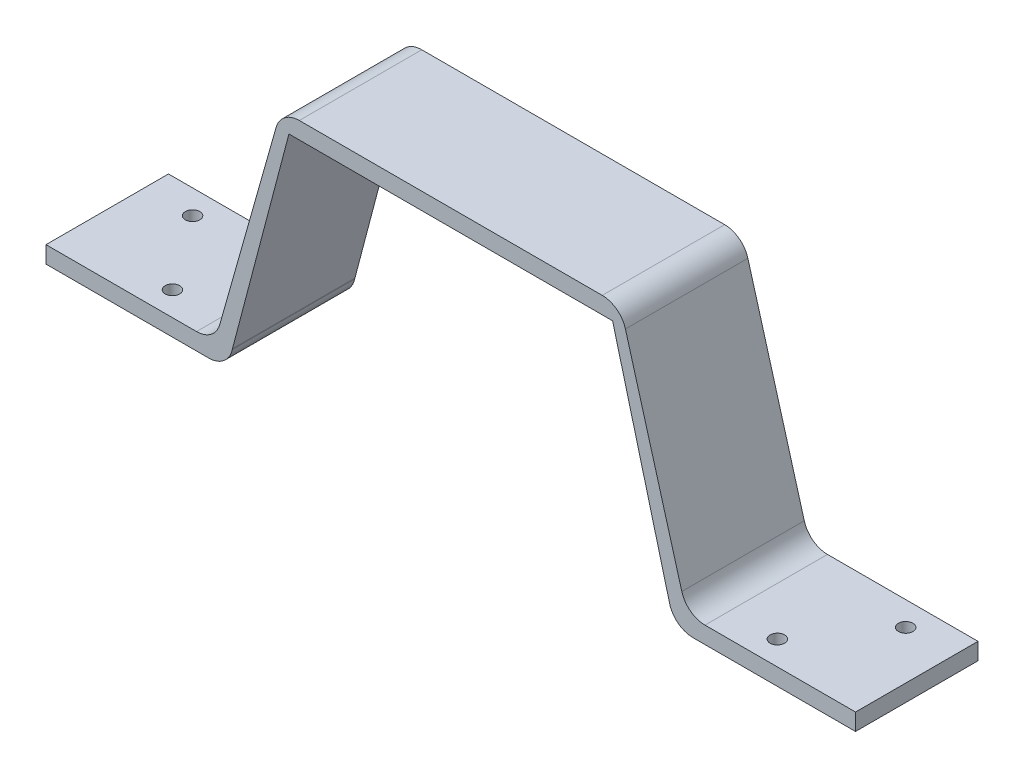
ISO-10303-21;
HEADER;
FILE_DESCRIPTION(('STEP AP214'),'2;1');
FILE_NAME('part.step','',(''),(''),'','','');
FILE_SCHEMA(('AUTOMOTIVE_DESIGN { 1 0 10303 214 1 1 1 1 }'));
ENDSEC;
DATA;
#1=APPLICATION_CONTEXT('core data for automotive mechanical design processes');
#2=APPLICATION_PROTOCOL_DEFINITION('international standard','automotive_design',2000,#1);
#3=PRODUCT_CONTEXT('',#1,'mechanical');
#4=PRODUCT('Part','Part','',(#3));
#5=PRODUCT_RELATED_PRODUCT_CATEGORY('part','',(#4));
#6=PRODUCT_DEFINITION_FORMATION('','',#4);
#7=PRODUCT_DEFINITION_CONTEXT('part definition',#1,'design');
#8=PRODUCT_DEFINITION('design','',#6,#7);
#9=PRODUCT_DEFINITION_SHAPE('','',#8);
#10=(LENGTH_UNIT() NAMED_UNIT(*) SI_UNIT(.MILLI.,.METRE.));
#11=(NAMED_UNIT(*) PLANE_ANGLE_UNIT() SI_UNIT($,.RADIAN.));
#12=(NAMED_UNIT(*) SI_UNIT($,.STERADIAN.) SOLID_ANGLE_UNIT());
#13=UNCERTAINTY_MEASURE_WITH_UNIT(LENGTH_MEASURE(1.E-05),#10,'distance_accuracy_value','');
#14=(GEOMETRIC_REPRESENTATION_CONTEXT(3) GLOBAL_UNCERTAINTY_ASSIGNED_CONTEXT((#13)) GLOBAL_UNIT_ASSIGNED_CONTEXT((#10,
#11,#12)) REPRESENTATION_CONTEXT('',''));
#15=CARTESIAN_POINT('',(0.,0.,0.));
#16=DIRECTION('',(0.,0.,1.));
#17=DIRECTION('',(1.,0.,0.));
#18=AXIS2_PLACEMENT_3D('',#15,#16,#17);
#19=CARTESIAN_POINT('',(-124.394,2.85183235274844,0.));
#20=DIRECTION('',(0.,0.,1.));
#21=DIRECTION('',(1.,0.,0.));
#22=AXIS2_PLACEMENT_3D('',#19,#20,#21);
#23=CYLINDRICAL_SURFACE('',#22,5.);
#24=CARTESIAN_POINT('',(-124.394,2.85183235274844,25.4));
#25=DIRECTION('',(0.,0.,1.));
#26=DIRECTION('',(1.,0.,0.));
#27=AXIS2_PLACEMENT_3D('',#24,#25,#26);
#28=CIRCLE('',#27,5.);
#29=CARTESIAN_POINT('',(-129.228728837836,4.12674296318334,25.4));
#30=VERTEX_POINT('',#29);
#31=CARTESIAN_POINT('',(-129.277271847832,3.92591617637421,25.4));
#32=VERTEX_POINT('',#31);
#33=EDGE_CURVE('E344',#30,#32,#28,.T.);
#34=ORIENTED_EDGE('',*,*,#33,.T.);
#35=DIRECTION('',(0.,0.,1.));
#36=VECTOR('',#35,1.);
#37=CARTESIAN_POINT('',(-129.277271847832,3.92591617637421,0.));
#38=LINE('',#37,#36);
#39=CARTESIAN_POINT('',(-129.277271847832,3.92591617637421,0.));
#40=VERTEX_POINT('',#39);
#41=EDGE_CURVE('E358',#32,#40,#38,.F.);
#42=ORIENTED_EDGE('',*,*,#41,.T.);
#43=CARTESIAN_POINT('',(-124.394,2.85183235274844,0.));
#44=DIRECTION('',(0.,0.,1.));
#45=DIRECTION('',(1.,0.,0.));
#46=AXIS2_PLACEMENT_3D('',#43,#44,#45);
#47=CIRCLE('',#46,5.);
#48=CARTESIAN_POINT('',(-129.228728837836,4.12674296318334,0.));
#49=VERTEX_POINT('',#48);
#50=EDGE_CURVE('E348',#40,#49,#47,.F.);
#51=ORIENTED_EDGE('',*,*,#50,.T.);
#52=DIRECTION('',(0.,0.,-1.));
#53=VECTOR('',#52,1.);
#54=CARTESIAN_POINT('',(-129.228728837836,4.12674296318338,0.));
#55=LINE('',#54,#53);
#56=EDGE_CURVE('E340',#30,#49,#55,.T.);
#57=ORIENTED_EDGE('',*,*,#56,.F.);
#58=EDGE_LOOP('',(#34,#42,#51,#57));
#59=FACE_BOUND('',#58,.T.);
#60=ADVANCED_FACE('F43',(#59),#23,.F.);
#61=CARTESIAN_POINT('',(-43.5,2.85183235274863,0.));
#62=DIRECTION('',(0.,0.,-1.));
#63=DIRECTION('',(-1.,0.,0.));
#64=AXIS2_PLACEMENT_3D('',#61,#62,#63);
#65=CYLINDRICAL_SURFACE('',#64,5.);
#66=CARTESIAN_POINT('',(-43.5,2.85183235274863,0.));
#67=DIRECTION('',(0.,0.,1.));
#68=DIRECTION('',(1.,0.,0.));
#69=AXIS2_PLACEMENT_3D('',#66,#67,#68);
#70=CIRCLE('',#69,5.);
#71=CARTESIAN_POINT('',(-38.6652711621643,4.12674296318362,0.));
#72=VERTEX_POINT('',#71);
#73=CARTESIAN_POINT('',(-38.6167281521683,3.92591617637431,0.));
#74=VERTEX_POINT('',#73);
#75=EDGE_CURVE('E207',#72,#74,#70,.F.);
#76=ORIENTED_EDGE('',*,*,#75,.T.);
#77=DIRECTION('',(0.,0.,-1.));
#78=VECTOR('',#77,1.);
#79=CARTESIAN_POINT('',(-38.6167281521683,3.92591617637431,0.));
#80=LINE('',#79,#78);
#81=CARTESIAN_POINT('',(-38.6167281521683,3.92591617637431,25.4));
#82=VERTEX_POINT('',#81);
#83=EDGE_CURVE('E364',#74,#82,#80,.F.);
#84=ORIENTED_EDGE('',*,*,#83,.T.);
#85=CARTESIAN_POINT('',(-43.5,2.85183235274863,25.4));
#86=DIRECTION('',(0.,0.,1.));
#87=DIRECTION('',(1.,0.,0.));
#88=AXIS2_PLACEMENT_3D('',#85,#86,#87);
#89=CIRCLE('',#88,5.);
#90=CARTESIAN_POINT('',(-38.6652711621643,4.12674296318362,25.4));
#91=VERTEX_POINT('',#90);
#92=EDGE_CURVE('E337',#82,#91,#89,.T.);
#93=ORIENTED_EDGE('',*,*,#92,.T.);
#94=DIRECTION('',(0.,0.,1.));
#95=VECTOR('',#94,1.);
#96=CARTESIAN_POINT('',(-38.6652711621643,4.12674296318361,0.));
#97=LINE('',#96,#95);
#98=EDGE_CURVE('E332',#72,#91,#97,.T.);
#99=ORIENTED_EDGE('',*,*,#98,.F.);
#100=EDGE_LOOP('',(#76,#84,#93,#99));
#101=FACE_BOUND('',#100,.T.);
#102=ADVANCED_FACE('F445',(#101),#65,.F.);
#103=CARTESIAN_POINT('',(-115.357391249547,47.07,25.4));
#104=DIRECTION('',(0.,0.,1.));
#105=DIRECTION('',(1.,0.,0.));
#106=AXIS2_PLACEMENT_3D('',#103,#104,#105);
#107=CYLINDRICAL_SURFACE('',#106,5.);
#108=DIRECTION('',(0.,0.,1.));
#109=VECTOR('',#108,1.);
#110=CARTESIAN_POINT('',(-115.357391249547,52.07,25.4));
#111=LINE('',#110,#109);
#112=CARTESIAN_POINT('',(-115.357391249547,52.07,0.));
#113=VERTEX_POINT('',#112);
#114=CARTESIAN_POINT('',(-115.357391249547,52.07,25.4));
#115=VERTEX_POINT('',#114);
#116=EDGE_CURVE('E317',#113,#115,#111,.T.);
#117=ORIENTED_EDGE('',*,*,#116,.F.);
#118=CARTESIAN_POINT('',(-115.357391249547,47.07,0.));
#119=DIRECTION('',(0.,0.,1.));
#120=DIRECTION('',(1.,0.,0.));
#121=AXIS2_PLACEMENT_3D('',#118,#119,#120);
#122=CIRCLE('',#121,5.);
#123=CARTESIAN_POINT('',(-120.1681665297,48.4325128270462,0.));
#124=VERTEX_POINT('',#123);
#125=EDGE_CURVE('E325',#124,#113,#122,.F.);
#126=ORIENTED_EDGE('',*,*,#125,.F.);
#127=DIRECTION('',(0.,0.,1.));
#128=VECTOR('',#127,1.);
#129=CARTESIAN_POINT('',(-120.1681665297,48.4325128270461,0.));
#130=LINE('',#129,#128);
#131=CARTESIAN_POINT('',(-120.1681665297,48.4325128270462,25.4));
#132=VERTEX_POINT('',#131);
#133=EDGE_CURVE('E321',#132,#124,#130,.F.);
#134=ORIENTED_EDGE('',*,*,#133,.F.);
#135=CARTESIAN_POINT('',(-115.357391249547,47.07,25.4));
#136=DIRECTION('',(0.,0.,1.));
#137=DIRECTION('',(1.,0.,0.));
#138=AXIS2_PLACEMENT_3D('',#135,#136,#137);
#139=CIRCLE('',#138,5.);
#140=EDGE_CURVE('E328',#115,#132,#139,.T.);
#141=ORIENTED_EDGE('',*,*,#140,.F.);
#142=EDGE_LOOP('',(#117,#126,#134,#141));
#143=FACE_BOUND('',#142,.T.);
#144=ADVANCED_FACE('F451',(#143),#107,.T.);
#145=CARTESIAN_POINT('',(-52.5366087504532,47.07,25.4));
#146=DIRECTION('',(0.,0.,1.));
#147=DIRECTION('',(1.,0.,0.));
#148=AXIS2_PLACEMENT_3D('',#145,#146,#147);
#149=CYLINDRICAL_SURFACE('',#148,5.);
#150=DIRECTION('',(0.,0.,-1.));
#151=VECTOR('',#150,1.);
#152=CARTESIAN_POINT('',(-52.5366087504532,52.07,25.4));
#153=LINE('',#152,#151);
#154=CARTESIAN_POINT('',(-52.5366087504532,52.07,25.4));
#155=VERTEX_POINT('',#154);
#156=CARTESIAN_POINT('',(-52.5366087504532,52.07,0.));
#157=VERTEX_POINT('',#156);
#158=EDGE_CURVE('E302',#155,#157,#153,.T.);
#159=ORIENTED_EDGE('',*,*,#158,.F.);
#160=CARTESIAN_POINT('',(-52.5366087504532,47.07,25.4));
#161=DIRECTION('',(0.,0.,1.));
#162=DIRECTION('',(1.,0.,0.));
#163=AXIS2_PLACEMENT_3D('',#160,#161,#162);
#164=CIRCLE('',#163,5.);
#165=CARTESIAN_POINT('',(-47.7258334702998,48.4325128270462,25.4));
#166=VERTEX_POINT('',#165);
#167=EDGE_CURVE('E310',#166,#155,#164,.T.);
#168=ORIENTED_EDGE('',*,*,#167,.F.);
#169=DIRECTION('',(0.,0.,-1.));
#170=VECTOR('',#169,1.);
#171=CARTESIAN_POINT('',(-47.7258334702998,48.4325128270462,25.4));
#172=LINE('',#171,#170);
#173=CARTESIAN_POINT('',(-47.7258334702998,48.4325128270462,0.));
#174=VERTEX_POINT('',#173);
#175=EDGE_CURVE('E306',#174,#166,#172,.F.);
#176=ORIENTED_EDGE('',*,*,#175,.F.);
#177=CARTESIAN_POINT('',(-52.5366087504532,47.07,0.));
#178=DIRECTION('',(0.,0.,1.));
#179=DIRECTION('',(1.,0.,0.));
#180=AXIS2_PLACEMENT_3D('',#177,#178,#179);
#181=CIRCLE('',#180,5.);
#182=EDGE_CURVE('E313',#157,#174,#181,.F.);
#183=ORIENTED_EDGE('',*,*,#182,.F.);
#184=EDGE_LOOP('',(#159,#168,#176,#183));
#185=FACE_BOUND('',#184,.T.);
#186=ADVANCED_FACE('F487',(#185),#149,.T.);
#187=CARTESIAN_POINT('',(0.,0.,25.4));
#188=DIRECTION('',(0.,1.,0.));
#189=DIRECTION('',(-1.,0.,0.));
#190=AXIS2_PLACEMENT_3D('',#187,#188,#189);
#191=PLANE('',#190);
#192=CARTESIAN_POINT('',(-21.2194376570029,0.,20.4));
#193=DIRECTION('',(0.,1.,0.));
#194=DIRECTION('',(-1.,0.,0.));
#195=AXIS2_PLACEMENT_3D('',#192,#193,#194);
#196=CIRCLE('',#195,1.5);
#197=CARTESIAN_POINT('',(-22.7194376570029,0.,20.4));
#198=VERTEX_POINT('',#197);
#199=EDGE_CURVE('E217',#198,#198,#196,.T.);
#200=ORIENTED_EDGE('',*,*,#199,.T.);
#201=EDGE_LOOP('',(#200));
#202=FACE_BOUND('',#201,.T.);
#203=CARTESIAN_POINT('',(-9.99999999999998,0.,5.));
#204=DIRECTION('',(0.,1.,0.));
#205=DIRECTION('',(-1.,0.,0.));
#206=AXIS2_PLACEMENT_3D('',#203,#204,#205);
#207=CIRCLE('',#206,1.5);
#208=CARTESIAN_POINT('',(-11.5,0.,5.));
#209=VERTEX_POINT('',#208);
#210=EDGE_CURVE('E410',#209,#209,#207,.T.);
#211=ORIENTED_EDGE('',*,*,#210,.T.);
#212=EDGE_LOOP('',(#211));
#213=FACE_BOUND('',#212,.T.);
#214=DIRECTION('',(1.,0.,0.));
#215=VECTOR('',#214,1.);
#216=CARTESIAN_POINT('',(0.,0.,25.4));
#217=LINE('',#216,#215);
#218=CARTESIAN_POINT('',(-33.7334563043366,0.,25.4));
#219=VERTEX_POINT('',#218);
#220=CARTESIAN_POINT('',(0.,0.,25.4));
#221=VERTEX_POINT('',#220);
#222=EDGE_CURVE('E275',#219,#221,#217,.T.);
#223=ORIENTED_EDGE('',*,*,#222,.F.);
#224=DIRECTION('',(0.,0.,-1.));
#225=VECTOR('',#224,1.);
#226=CARTESIAN_POINT('',(-33.7334563043366,0.,25.4));
#227=LINE('',#226,#225);
#228=CARTESIAN_POINT('',(-33.7334563043366,0.,0.));
#229=VERTEX_POINT('',#228);
#230=EDGE_CURVE('E371',#219,#229,#227,.T.);
#231=ORIENTED_EDGE('',*,*,#230,.T.);
#232=DIRECTION('',(1.,0.,0.));
#233=VECTOR('',#232,1.);
#234=CARTESIAN_POINT('',(0.,0.,0.));
#235=LINE('',#234,#233);
#236=CARTESIAN_POINT('',(0.,0.,0.));
#237=VERTEX_POINT('',#236);
#238=EDGE_CURVE('E291',#229,#237,#235,.T.);
#239=ORIENTED_EDGE('',*,*,#238,.T.);
#240=DIRECTION('',(0.,0.,-1.));
#241=VECTOR('',#240,1.);
#242=CARTESIAN_POINT('',(0.,0.,25.4));
#243=LINE('',#242,#241);
#244=EDGE_CURVE('E280',#221,#237,#243,.T.);
#245=ORIENTED_EDGE('',*,*,#244,.F.);
#246=EDGE_LOOP('',(#223,#231,#239,#245));
#247=FACE_BOUND('',#246,.T.);
#248=ADVANCED_FACE('F548',(#202,#213,#247),#191,.F.);
#249=CARTESIAN_POINT('',(0.,0.,25.4));
#250=DIRECTION('',(-1.,0.,0.));
#251=DIRECTION('',(0.,0.,1.));
#252=AXIS2_PLACEMENT_3D('',#249,#250,#251);
#253=PLANE('',#252);
#254=DIRECTION('',(0.,0.,1.));
#255=VECTOR('',#254,1.);
#256=CARTESIAN_POINT('',(0.,3.49999999999998,0.));
#257=LINE('',#256,#255);
#258=CARTESIAN_POINT('',(0.,3.49999999999998,0.));
#259=VERTEX_POINT('',#258);
#260=CARTESIAN_POINT('',(0.,3.49999999999998,25.4));
#261=VERTEX_POINT('',#260);
#262=EDGE_CURVE('E242',#259,#261,#257,.T.);
#263=ORIENTED_EDGE('',*,*,#262,.T.);
#264=DIRECTION('',(0.,1.,0.));
#265=VECTOR('',#264,1.);
#266=CARTESIAN_POINT('',(0.,0.,25.4));
#267=LINE('',#266,#265);
#268=EDGE_CURVE('E263',#221,#261,#267,.T.);
#269=ORIENTED_EDGE('',*,*,#268,.F.);
#270=ORIENTED_EDGE('',*,*,#244,.T.);
#271=DIRECTION('',(0.,1.,0.));
#272=VECTOR('',#271,1.);
#273=CARTESIAN_POINT('',(0.,0.,0.));
#274=LINE('',#273,#272);
#275=EDGE_CURVE('E247',#237,#259,#274,.T.);
#276=ORIENTED_EDGE('',*,*,#275,.T.);
#277=EDGE_LOOP('',(#263,#269,#270,#276));
#278=FACE_BOUND('',#277,.T.);
#279=ADVANCED_FACE('F500',(#278),#253,.F.);
#280=CARTESIAN_POINT('',(0.,52.07,25.4));
#281=DIRECTION('',(0.,-1.,0.));
#282=DIRECTION('',(1.,0.,0.));
#283=AXIS2_PLACEMENT_3D('',#280,#281,#282);
#284=PLANE('',#283);
#285=DIRECTION('',(-1.,0.,0.));
#286=VECTOR('',#285,1.);
#287=CARTESIAN_POINT('',(0.,52.07,0.));
#288=LINE('',#287,#286);
#289=EDGE_CURVE('E284',#157,#113,#288,.T.);
#290=ORIENTED_EDGE('',*,*,#289,.T.);
#291=ORIENTED_EDGE('',*,*,#116,.T.);
#292=DIRECTION('',(-1.,0.,0.));
#293=VECTOR('',#292,1.);
#294=CARTESIAN_POINT('',(0.,52.07,25.4));
#295=LINE('',#294,#293);
#296=EDGE_CURVE('E267',#155,#115,#295,.T.);
#297=ORIENTED_EDGE('',*,*,#296,.F.);
#298=ORIENTED_EDGE('',*,*,#158,.T.);
#299=EDGE_LOOP('',(#290,#291,#297,#298));
#300=FACE_BOUND('',#299,.T.);
#301=ADVANCED_FACE('F482',(#300),#284,.F.);
#302=CARTESIAN_POINT('',(0.,0.,25.4));
#303=DIRECTION('',(0.,0.,1.));
#304=DIRECTION('',(1.,0.,0.));
#305=AXIS2_PLACEMENT_3D('',#302,#303,#304);
#306=PLANE('',#305);
#307=ORIENTED_EDGE('',*,*,#92,.F.);
#308=CARTESIAN_POINT('',(-33.7334563043366,5.,25.4));
#309=DIRECTION('',(0.,0.,1.));
#310=DIRECTION('',(1.,0.,0.));
#311=AXIS2_PLACEMENT_3D('',#308,#309,#310);
#312=CIRCLE('',#311,5.);
#313=EDGE_CURVE('E368',#82,#219,#312,.T.);
#314=ORIENTED_EDGE('',*,*,#313,.T.);
#315=ORIENTED_EDGE('',*,*,#222,.T.);
#316=ORIENTED_EDGE('',*,*,#268,.T.);
#317=DIRECTION('',(-1.,0.,0.));
#318=VECTOR('',#317,1.);
#319=CARTESIAN_POINT('',(0.,3.49999999999998,25.4));
#320=LINE('',#319,#318);
#321=CARTESIAN_POINT('',(-31.2194376570029,3.49999999999998,25.4));
#322=VERTEX_POINT('',#321);
#323=EDGE_CURVE('E252',#261,#322,#320,.T.);
#324=ORIENTED_EDGE('',*,*,#323,.T.);
#325=CARTESIAN_POINT('',(-31.2194376570029,8.49999999999998,25.4));
#326=DIRECTION('',(0.,0.,1.));
#327=DIRECTION('',(1.,0.,0.));
#328=AXIS2_PLACEMENT_3D('',#325,#326,#327);
#329=CIRCLE('',#328,5.);
#330=CARTESIAN_POINT('',(-36.0302129371563,7.13748717295383,25.4));
#331=VERTEX_POINT('',#330);
#332=EDGE_CURVE('E53',#322,#331,#329,.F.);
#333=ORIENTED_EDGE('',*,*,#332,.T.);
#334=DIRECTION('',(-0.272502565409232,0.962155056030673,0.));
#335=VECTOR('',#334,1.);
#336=CARTESIAN_POINT('',(-31.4833182907742,-8.91673846960262,25.4));
#337=LINE('',#336,#335);
#338=EDGE_CURVE('E227',#331,#166,#337,.T.);
#339=ORIENTED_EDGE('',*,*,#338,.T.);
#340=ORIENTED_EDGE('',*,*,#167,.T.);
#341=ORIENTED_EDGE('',*,*,#296,.T.);
#342=ORIENTED_EDGE('',*,*,#140,.T.);
#343=DIRECTION('',(0.272502565409232,0.962155056030673,0.));
#344=VECTOR('',#343,1.);
#345=CARTESIAN_POINT('',(-123.943268129955,35.1033425630519,25.4));
#346=LINE('',#345,#344);
#347=CARTESIAN_POINT('',(-131.863787062844,7.13748717295381,25.4));
#348=VERTEX_POINT('',#347);
#349=EDGE_CURVE('E234',#348,#132,#346,.T.);
#350=ORIENTED_EDGE('',*,*,#349,.F.);
#351=CARTESIAN_POINT('',(-136.674562342997,8.49999999999998,25.4));
#352=DIRECTION('',(0.,0.,1.));
#353=DIRECTION('',(1.,0.,0.));
#354=AXIS2_PLACEMENT_3D('',#351,#352,#353);
#355=CIRCLE('',#354,5.);
#356=CARTESIAN_POINT('',(-136.674562342997,3.49999999999998,25.4));
#357=VERTEX_POINT('',#356);
#358=EDGE_CURVE('E390',#348,#357,#355,.F.);
#359=ORIENTED_EDGE('',*,*,#358,.T.);
#360=DIRECTION('',(1.,0.,0.));
#361=VECTOR('',#360,1.);
#362=CARTESIAN_POINT('',(0.,3.49999999999997,25.4));
#363=LINE('',#362,#361);
#364=CARTESIAN_POINT('',(-167.894,3.49999999999998,25.4));
#365=VERTEX_POINT('',#364);
#366=EDGE_CURVE('E238',#365,#357,#363,.T.);
#367=ORIENTED_EDGE('',*,*,#366,.F.);
#368=DIRECTION('',(0.,-1.,0.));
#369=VECTOR('',#368,1.);
#370=CARTESIAN_POINT('',(-167.894,0.,25.4));
#371=LINE('',#370,#369);
#372=CARTESIAN_POINT('',(-167.894,0.,25.4));
#373=VERTEX_POINT('',#372);
#374=EDGE_CURVE('E272',#365,#373,#371,.T.);
#375=ORIENTED_EDGE('',*,*,#374,.T.);
#376=CARTESIAN_POINT('',(-134.160543695663,0.,25.4));
#377=VERTEX_POINT('',#376);
#378=EDGE_CURVE('E276',#373,#377,#217,.T.);
#379=ORIENTED_EDGE('',*,*,#378,.T.);
#380=CARTESIAN_POINT('',(-134.160543695663,4.99999999999998,25.4));
#381=DIRECTION('',(0.,0.,1.));
#382=DIRECTION('',(1.,0.,0.));
#383=AXIS2_PLACEMENT_3D('',#380,#381,#382);
#384=CIRCLE('',#383,5.);
#385=EDGE_CURVE('E355',#377,#32,#384,.T.);
#386=ORIENTED_EDGE('',*,*,#385,.T.);
#387=ORIENTED_EDGE('',*,*,#33,.F.);
#388=DIRECTION('',(-0.254982122086988,-0.966945767567146,0.));
#389=VECTOR('',#388,1.);
#390=CARTESIAN_POINT('',(-121.844273482079,32.1301488239363,25.4));
#391=LINE('',#390,#389);
#392=CARTESIAN_POINT('',(-117.509109835607,48.57,25.4));
#393=VERTEX_POINT('',#392);
#394=EDGE_CURVE('E210',#393,#30,#391,.T.);
#395=ORIENTED_EDGE('',*,*,#394,.F.);
#396=DIRECTION('',(1.,0.,0.));
#397=VECTOR('',#396,1.);
#398=CARTESIAN_POINT('',(0.,48.57,25.4));
#399=LINE('',#398,#397);
#400=CARTESIAN_POINT('',(-50.3848901643937,48.57,25.4));
#401=VERTEX_POINT('',#400);
#402=EDGE_CURVE('E214',#393,#401,#399,.T.);
#403=ORIENTED_EDGE('',*,*,#402,.T.);
#404=DIRECTION('',(0.254982122086995,-0.966945767567144,0.));
#405=VECTOR('',#404,1.);
#406=CARTESIAN_POINT('',(-35.1339499273659,-9.26476893561242,25.4));
#407=LINE('',#406,#405);
#408=EDGE_CURVE('E200',#401,#91,#407,.T.);
#409=ORIENTED_EDGE('',*,*,#408,.T.);
#410=EDGE_LOOP('',(#307,#314,#315,#316,#324,#333,#339,#340,#341,#342,#350,#359,#367,#375,#379,
#386,#387,#395,#403,#409));
#411=FACE_BOUND('',#410,.T.);
#412=ADVANCED_FACE('F495',(#411),#306,.T.);
#413=CARTESIAN_POINT('',(0.,0.,0.));
#414=DIRECTION('',(0.,0.,1.));
#415=DIRECTION('',(1.,0.,0.));
#416=AXIS2_PLACEMENT_3D('',#413,#414,#415);
#417=PLANE('',#416);
#418=ORIENTED_EDGE('',*,*,#238,.F.);
#419=CARTESIAN_POINT('',(-33.7334563043366,5.,0.));
#420=DIRECTION('',(0.,0.,1.));
#421=DIRECTION('',(1.,0.,0.));
#422=AXIS2_PLACEMENT_3D('',#419,#420,#421);
#423=CIRCLE('',#422,5.);
#424=EDGE_CURVE('E374',#229,#74,#423,.F.);
#425=ORIENTED_EDGE('',*,*,#424,.T.);
#426=ORIENTED_EDGE('',*,*,#75,.F.);
#427=DIRECTION('',(0.254982122086995,-0.966945767567144,0.));
#428=VECTOR('',#427,1.);
#429=CARTESIAN_POINT('',(-35.1339499273659,-9.26476893561242,0.));
#430=LINE('',#429,#428);
#431=CARTESIAN_POINT('',(-50.3848901643937,48.57,0.));
#432=VERTEX_POINT('',#431);
#433=EDGE_CURVE('E193',#432,#72,#430,.T.);
#434=ORIENTED_EDGE('',*,*,#433,.F.);
#435=DIRECTION('',(1.,0.,0.));
#436=VECTOR('',#435,1.);
#437=CARTESIAN_POINT('',(0.,48.57,0.));
#438=LINE('',#437,#436);
#439=CARTESIAN_POINT('',(-117.509109835607,48.57,0.));
#440=VERTEX_POINT('',#439);
#441=EDGE_CURVE('E180',#440,#432,#438,.T.);
#442=ORIENTED_EDGE('',*,*,#441,.F.);
#443=DIRECTION('',(-0.254982122086988,-0.966945767567146,0.));
#444=VECTOR('',#443,1.);
#445=CARTESIAN_POINT('',(-121.844273482079,32.1301488239363,0.));
#446=LINE('',#445,#444);
#447=EDGE_CURVE('E192',#440,#49,#446,.T.);
#448=ORIENTED_EDGE('',*,*,#447,.T.);
#449=ORIENTED_EDGE('',*,*,#50,.F.);
#450=CARTESIAN_POINT('',(-134.160543695663,4.99999999999998,0.));
#451=DIRECTION('',(0.,0.,1.));
#452=DIRECTION('',(1.,0.,0.));
#453=AXIS2_PLACEMENT_3D('',#450,#451,#452);
#454=CIRCLE('',#453,5.);
#455=CARTESIAN_POINT('',(-134.160543695663,0.,0.));
#456=VERTEX_POINT('',#455);
#457=EDGE_CURVE('E361',#40,#456,#454,.F.);
#458=ORIENTED_EDGE('',*,*,#457,.T.);
#459=CARTESIAN_POINT('',(-167.894,0.,0.));
#460=VERTEX_POINT('',#459);
#461=EDGE_CURVE('E268',#460,#456,#235,.T.);
#462=ORIENTED_EDGE('',*,*,#461,.F.);
#463=DIRECTION('',(0.,-1.,0.));
#464=VECTOR('',#463,1.);
#465=CARTESIAN_POINT('',(-167.894,0.,0.));
#466=LINE('',#465,#464);
#467=CARTESIAN_POINT('',(-167.894,3.49999999999998,0.));
#468=VERTEX_POINT('',#467);
#469=EDGE_CURVE('E288',#468,#460,#466,.T.);
#470=ORIENTED_EDGE('',*,*,#469,.F.);
#471=DIRECTION('',(1.,0.,0.));
#472=VECTOR('',#471,1.);
#473=CARTESIAN_POINT('',(0.,3.49999999999997,0.));
#474=LINE('',#473,#472);
#475=CARTESIAN_POINT('',(-136.674562342997,3.49999999999998,0.));
#476=VERTEX_POINT('',#475);
#477=EDGE_CURVE('E229',#468,#476,#474,.T.);
#478=ORIENTED_EDGE('',*,*,#477,.T.);
#479=CARTESIAN_POINT('',(-136.674562342997,8.49999999999998,0.));
#480=DIRECTION('',(0.,0.,1.));
#481=DIRECTION('',(1.,0.,0.));
#482=AXIS2_PLACEMENT_3D('',#479,#480,#481);
#483=CIRCLE('',#482,5.);
#484=CARTESIAN_POINT('',(-131.863787062844,7.13748717295381,0.));
#485=VERTEX_POINT('',#484);
#486=EDGE_CURVE('E393',#476,#485,#483,.T.);
#487=ORIENTED_EDGE('',*,*,#486,.T.);
#488=DIRECTION('',(0.272502565409232,0.962155056030673,0.));
#489=VECTOR('',#488,1.);
#490=CARTESIAN_POINT('',(-123.943268129955,35.1033425630519,0.));
#491=LINE('',#490,#489);
#492=EDGE_CURVE('E233',#485,#124,#491,.T.);
#493=ORIENTED_EDGE('',*,*,#492,.T.);
#494=ORIENTED_EDGE('',*,*,#125,.T.);
#495=ORIENTED_EDGE('',*,*,#289,.F.);
#496=ORIENTED_EDGE('',*,*,#182,.T.);
#497=DIRECTION('',(-0.272502565409232,0.962155056030673,0.));
#498=VECTOR('',#497,1.);
#499=CARTESIAN_POINT('',(-31.4833182907742,-8.91673846960262,0.));
#500=LINE('',#499,#498);
#501=CARTESIAN_POINT('',(-36.0302129371563,7.13748717295383,0.));
#502=VERTEX_POINT('',#501);
#503=EDGE_CURVE('E248',#502,#174,#500,.T.);
#504=ORIENTED_EDGE('',*,*,#503,.F.);
#505=CARTESIAN_POINT('',(-31.2194376570029,8.49999999999998,0.));
#506=DIRECTION('',(0.,0.,1.));
#507=DIRECTION('',(1.,0.,0.));
#508=AXIS2_PLACEMENT_3D('',#505,#506,#507);
#509=CIRCLE('',#508,5.);
#510=CARTESIAN_POINT('',(-31.2194376570029,3.49999999999998,0.));
#511=VERTEX_POINT('',#510);
#512=EDGE_CURVE('E11',#502,#511,#509,.T.);
#513=ORIENTED_EDGE('',*,*,#512,.T.);
#514=DIRECTION('',(-1.,0.,0.));
#515=VECTOR('',#514,1.);
#516=CARTESIAN_POINT('',(0.,3.49999999999998,0.));
#517=LINE('',#516,#515);
#518=EDGE_CURVE('E251',#259,#511,#517,.T.);
#519=ORIENTED_EDGE('',*,*,#518,.F.);
#520=ORIENTED_EDGE('',*,*,#275,.F.);
#521=EDGE_LOOP('',(#418,#425,#426,#434,#442,#448,#449,#458,#462,#470,#478,#487,#493,#494,#495,
#496,#504,#513,#519,#520));
#522=FACE_BOUND('',#521,.T.);
#523=ADVANCED_FACE('F205',(#522),#417,.F.);
#524=CARTESIAN_POINT('',(-167.894,0.,25.4));
#525=DIRECTION('',(1.,0.,0.));
#526=DIRECTION('',(0.,0.,-1.));
#527=AXIS2_PLACEMENT_3D('',#524,#525,#526);
#528=PLANE('',#527);
#529=ORIENTED_EDGE('',*,*,#374,.F.);
#530=DIRECTION('',(0.,0.,1.));
#531=VECTOR('',#530,1.);
#532=CARTESIAN_POINT('',(-167.894,3.49999999999998,0.));
#533=LINE('',#532,#531);
#534=EDGE_CURVE('E237',#468,#365,#533,.T.);
#535=ORIENTED_EDGE('',*,*,#534,.F.);
#536=ORIENTED_EDGE('',*,*,#469,.T.);
#537=DIRECTION('',(0.,0.,-1.));
#538=VECTOR('',#537,1.);
#539=CARTESIAN_POINT('',(-167.894,0.,25.4));
#540=LINE('',#539,#538);
#541=EDGE_CURVE('E298',#373,#460,#540,.T.);
#542=ORIENTED_EDGE('',*,*,#541,.F.);
#543=EDGE_LOOP('',(#529,#535,#536,#542));
#544=FACE_BOUND('',#543,.T.);
#545=ADVANCED_FACE('F522',(#544),#528,.F.);
#546=CARTESIAN_POINT('',(-157.894,0.,5.));
#547=DIRECTION('',(0.,1.,0.));
#548=DIRECTION('',(-1.,0.,0.));
#549=AXIS2_PLACEMENT_3D('',#546,#547,#548);
#550=CIRCLE('',#549,1.5);
#551=CARTESIAN_POINT('',(-159.394,0.,5.));
#552=VERTEX_POINT('',#551);
#553=EDGE_CURVE('E406',#552,#552,#550,.T.);
#554=ORIENTED_EDGE('',*,*,#553,.T.);
#555=EDGE_LOOP('',(#554));
#556=FACE_BOUND('',#555,.T.);
#557=CARTESIAN_POINT('',(-146.674562342997,0.,20.4));
#558=DIRECTION('',(0.,1.,0.));
#559=DIRECTION('',(-1.,0.,0.));
#560=AXIS2_PLACEMENT_3D('',#557,#558,#559);
#561=CIRCLE('',#560,1.5);
#562=CARTESIAN_POINT('',(-148.174562342997,0.,20.4));
#563=VERTEX_POINT('',#562);
#564=EDGE_CURVE('E402',#563,#563,#561,.T.);
#565=ORIENTED_EDGE('',*,*,#564,.T.);
#566=EDGE_LOOP('',(#565));
#567=FACE_BOUND('',#566,.T.);
#568=ORIENTED_EDGE('',*,*,#461,.T.);
#569=DIRECTION('',(0.,0.,1.));
#570=VECTOR('',#569,1.);
#571=CARTESIAN_POINT('',(-134.160543695663,0.,25.4));
#572=LINE('',#571,#570);
#573=EDGE_CURVE('E351',#456,#377,#572,.T.);
#574=ORIENTED_EDGE('',*,*,#573,.T.);
#575=ORIENTED_EDGE('',*,*,#378,.F.);
#576=ORIENTED_EDGE('',*,*,#541,.T.);
#577=EDGE_LOOP('',(#568,#574,#575,#576));
#578=FACE_BOUND('',#577,.T.);
#579=ADVANCED_FACE('F425',(#556,#567,#578),#191,.F.);
#580=CARTESIAN_POINT('',(0.,3.49999999999998,0.));
#581=DIRECTION('',(0.,1.,0.));
#582=DIRECTION('',(-1.,0.,0.));
#583=AXIS2_PLACEMENT_3D('',#580,#581,#582);
#584=PLANE('',#583);
#585=CARTESIAN_POINT('',(-21.2194376570029,3.49999999999998,20.4));
#586=DIRECTION('',(0.,1.,0.));
#587=DIRECTION('',(-1.,0.,0.));
#588=AXIS2_PLACEMENT_3D('',#585,#586,#587);
#589=CIRCLE('',#588,1.5);
#590=CARTESIAN_POINT('',(-22.7194376570029,3.49999999999998,20.4));
#591=VERTEX_POINT('',#590);
#592=EDGE_CURVE('E47',#591,#591,#589,.T.);
#593=ORIENTED_EDGE('',*,*,#592,.F.);
#594=EDGE_LOOP('',(#593));
#595=FACE_BOUND('',#594,.T.);
#596=CARTESIAN_POINT('',(-9.99999999999998,3.49999999999998,5.));
#597=DIRECTION('',(0.,1.,0.));
#598=DIRECTION('',(-1.,0.,0.));
#599=AXIS2_PLACEMENT_3D('',#596,#597,#598);
#600=CIRCLE('',#599,1.5);
#601=CARTESIAN_POINT('',(-11.5,3.49999999999998,5.));
#602=VERTEX_POINT('',#601);
#603=EDGE_CURVE('E407',#602,#602,#600,.T.);
#604=ORIENTED_EDGE('',*,*,#603,.F.);
#605=EDGE_LOOP('',(#604));
#606=FACE_BOUND('',#605,.T.);
#607=ORIENTED_EDGE('',*,*,#518,.T.);
#608=DIRECTION('',(0.,0.,1.));
#609=VECTOR('',#608,1.);
#610=CARTESIAN_POINT('',(-31.2194376570029,3.49999999999998,25.4));
#611=LINE('',#610,#609);
#612=EDGE_CURVE('E384',#511,#322,#611,.T.);
#613=ORIENTED_EDGE('',*,*,#612,.T.);
#614=ORIENTED_EDGE('',*,*,#323,.F.);
#615=ORIENTED_EDGE('',*,*,#262,.F.);
#616=EDGE_LOOP('',(#607,#613,#614,#615));
#617=FACE_BOUND('',#616,.T.);
#618=ADVANCED_FACE('F493',(#595,#606,#617),#584,.T.);
#619=CARTESIAN_POINT('',(-31.4833182907742,-8.91673846960262,0.));
#620=DIRECTION('',(0.962155056030673,0.272502565409232,0.));
#621=DIRECTION('',(-0.272502565409232,0.962155056030673,0.));
#622=AXIS2_PLACEMENT_3D('',#619,#620,#621);
#623=PLANE('',#622);
#624=ORIENTED_EDGE('',*,*,#338,.F.);
#625=DIRECTION('',(0.,0.,1.));
#626=VECTOR('',#625,1.);
#627=CARTESIAN_POINT('',(-36.0302129371563,7.13748717295382,0.));
#628=LINE('',#627,#626);
#629=EDGE_CURVE('E67',#331,#502,#628,.F.);
#630=ORIENTED_EDGE('',*,*,#629,.T.);
#631=ORIENTED_EDGE('',*,*,#503,.T.);
#632=ORIENTED_EDGE('',*,*,#175,.T.);
#633=EDGE_LOOP('',(#624,#630,#631,#632));
#634=FACE_BOUND('',#633,.T.);
#635=ADVANCED_FACE('F488',(#634),#623,.T.);
#636=CARTESIAN_POINT('',(-123.943268129955,35.1033425630519,0.));
#637=DIRECTION('',(0.962155056030673,-0.272502565409232,0.));
#638=DIRECTION('',(0.272502565409232,0.962155056030673,0.));
#639=AXIS2_PLACEMENT_3D('',#636,#637,#638);
#640=PLANE('',#639);
#641=ORIENTED_EDGE('',*,*,#492,.F.);
#642=DIRECTION('',(0.,0.,1.));
#643=VECTOR('',#642,1.);
#644=CARTESIAN_POINT('',(-131.863787062844,7.13748717295382,25.4));
#645=LINE('',#644,#643);
#646=EDGE_CURVE('E377',#485,#348,#645,.T.);
#647=ORIENTED_EDGE('',*,*,#646,.T.);
#648=ORIENTED_EDGE('',*,*,#349,.T.);
#649=ORIENTED_EDGE('',*,*,#133,.T.);
#650=EDGE_LOOP('',(#641,#647,#648,#649));
#651=FACE_BOUND('',#650,.T.);
#652=ADVANCED_FACE('F474',(#651),#640,.F.);
#653=CARTESIAN_POINT('',(0.,3.49999999999997,0.));
#654=DIRECTION('',(0.,-1.,0.));
#655=DIRECTION('',(1.,0.,0.));
#656=AXIS2_PLACEMENT_3D('',#653,#654,#655);
#657=PLANE('',#656);
#658=CARTESIAN_POINT('',(-157.894,3.49999999999998,5.));
#659=DIRECTION('',(0.,-1.,0.));
#660=DIRECTION('',(1.,0.,0.));
#661=AXIS2_PLACEMENT_3D('',#658,#659,#660);
#662=CIRCLE('',#661,1.5);
#663=CARTESIAN_POINT('',(-156.394,3.49999999999998,5.));
#664=VERTEX_POINT('',#663);
#665=EDGE_CURVE('E403',#664,#664,#662,.T.);
#666=ORIENTED_EDGE('',*,*,#665,.T.);
#667=EDGE_LOOP('',(#666));
#668=FACE_BOUND('',#667,.T.);
#669=CARTESIAN_POINT('',(-146.674562342997,3.49999999999998,20.4));
#670=DIRECTION('',(0.,-1.,0.));
#671=DIRECTION('',(1.,0.,0.));
#672=AXIS2_PLACEMENT_3D('',#669,#670,#671);
#673=CIRCLE('',#672,1.5);
#674=CARTESIAN_POINT('',(-145.174562342997,3.49999999999998,20.4));
#675=VERTEX_POINT('',#674);
#676=EDGE_CURVE('E398',#675,#675,#673,.T.);
#677=ORIENTED_EDGE('',*,*,#676,.T.);
#678=EDGE_LOOP('',(#677));
#679=FACE_BOUND('',#678,.T.);
#680=ORIENTED_EDGE('',*,*,#366,.T.);
#681=DIRECTION('',(0.,0.,1.));
#682=VECTOR('',#681,1.);
#683=CARTESIAN_POINT('',(-136.674562342997,3.49999999999998,0.));
#684=LINE('',#683,#682);
#685=EDGE_CURVE('E381',#357,#476,#684,.F.);
#686=ORIENTED_EDGE('',*,*,#685,.T.);
#687=ORIENTED_EDGE('',*,*,#477,.F.);
#688=ORIENTED_EDGE('',*,*,#534,.T.);
#689=EDGE_LOOP('',(#680,#686,#687,#688));
#690=FACE_BOUND('',#689,.T.);
#691=ADVANCED_FACE('F524',(#668,#679,#690),#657,.F.);
#692=CARTESIAN_POINT('',(-121.844273482079,32.1301488239363,0.));
#693=DIRECTION('',(-0.966945767567146,0.254982122086988,0.));
#694=DIRECTION('',(-0.254982122086988,-0.966945767567146,0.));
#695=AXIS2_PLACEMENT_3D('',#692,#693,#694);
#696=PLANE('',#695);
#697=ORIENTED_EDGE('',*,*,#394,.T.);
#698=ORIENTED_EDGE('',*,*,#56,.T.);
#699=ORIENTED_EDGE('',*,*,#447,.F.);
#700=DIRECTION('',(0.,0.,1.));
#701=VECTOR('',#700,1.);
#702=CARTESIAN_POINT('',(-117.509109835607,48.57,0.));
#703=LINE('',#702,#701);
#704=EDGE_CURVE('E186',#440,#393,#703,.T.);
#705=ORIENTED_EDGE('',*,*,#704,.T.);
#706=EDGE_LOOP('',(#697,#698,#699,#705));
#707=FACE_BOUND('',#706,.T.);
#708=ADVANCED_FACE('F510',(#707),#696,.F.);
#709=CARTESIAN_POINT('',(0.,48.57,0.));
#710=DIRECTION('',(0.,-1.,0.));
#711=DIRECTION('',(1.,0.,0.));
#712=AXIS2_PLACEMENT_3D('',#709,#710,#711);
#713=PLANE('',#712);
#714=ORIENTED_EDGE('',*,*,#402,.F.);
#715=ORIENTED_EDGE('',*,*,#704,.F.);
#716=ORIENTED_EDGE('',*,*,#441,.T.);
#717=DIRECTION('',(0.,0.,1.));
#718=VECTOR('',#717,1.);
#719=CARTESIAN_POINT('',(-50.3848901643937,48.57,0.));
#720=LINE('',#719,#718);
#721=EDGE_CURVE('E184',#432,#401,#720,.T.);
#722=ORIENTED_EDGE('',*,*,#721,.T.);
#723=EDGE_LOOP('',(#714,#715,#716,#722));
#724=FACE_BOUND('',#723,.T.);
#725=ADVANCED_FACE('F183',(#724),#713,.T.);
#726=CARTESIAN_POINT('',(-35.1339499273659,-9.26476893561242,0.));
#727=DIRECTION('',(-0.966945767567144,-0.254982122086995,0.));
#728=DIRECTION('',(0.254982122086995,-0.966945767567144,0.));
#729=AXIS2_PLACEMENT_3D('',#726,#727,#728);
#730=PLANE('',#729);
#731=ORIENTED_EDGE('',*,*,#433,.T.);
#732=ORIENTED_EDGE('',*,*,#98,.T.);
#733=ORIENTED_EDGE('',*,*,#408,.F.);
#734=ORIENTED_EDGE('',*,*,#721,.F.);
#735=EDGE_LOOP('',(#731,#732,#733,#734));
#736=FACE_BOUND('',#735,.T.);
#737=ADVANCED_FACE('F197',(#736),#730,.T.);
#738=CARTESIAN_POINT('',(-134.160543695663,4.99999999999998,0.));
#739=DIRECTION('',(0.,0.,1.));
#740=DIRECTION('',(1.,0.,0.));
#741=AXIS2_PLACEMENT_3D('',#738,#739,#740);
#742=CYLINDRICAL_SURFACE('',#741,5.);
#743=ORIENTED_EDGE('',*,*,#457,.F.);
#744=ORIENTED_EDGE('',*,*,#41,.F.);
#745=ORIENTED_EDGE('',*,*,#385,.F.);
#746=ORIENTED_EDGE('',*,*,#573,.F.);
#747=EDGE_LOOP('',(#743,#744,#745,#746));
#748=FACE_BOUND('',#747,.T.);
#749=ADVANCED_FACE('F456',(#748),#742,.T.);
#750=CARTESIAN_POINT('',(-33.7334563043366,5.,0.));
#751=DIRECTION('',(0.,0.,-1.));
#752=DIRECTION('',(-1.,0.,0.));
#753=AXIS2_PLACEMENT_3D('',#750,#751,#752);
#754=CYLINDRICAL_SURFACE('',#753,5.);
#755=ORIENTED_EDGE('',*,*,#424,.F.);
#756=ORIENTED_EDGE('',*,*,#230,.F.);
#757=ORIENTED_EDGE('',*,*,#313,.F.);
#758=ORIENTED_EDGE('',*,*,#83,.F.);
#759=EDGE_LOOP('',(#755,#756,#757,#758));
#760=FACE_BOUND('',#759,.T.);
#761=ADVANCED_FACE('F459',(#760),#754,.T.);
#762=CARTESIAN_POINT('',(-136.674562342997,8.49999999999998,0.));
#763=DIRECTION('',(0.,0.,-1.));
#764=DIRECTION('',(-1.,0.,0.));
#765=AXIS2_PLACEMENT_3D('',#762,#763,#764);
#766=CYLINDRICAL_SURFACE('',#765,5.);
#767=ORIENTED_EDGE('',*,*,#486,.F.);
#768=ORIENTED_EDGE('',*,*,#685,.F.);
#769=ORIENTED_EDGE('',*,*,#358,.F.);
#770=ORIENTED_EDGE('',*,*,#646,.F.);
#771=EDGE_LOOP('',(#767,#768,#769,#770));
#772=FACE_BOUND('',#771,.T.);
#773=ADVANCED_FACE('F440',(#772),#766,.F.);
#774=CARTESIAN_POINT('',(-31.2194376570029,8.49999999999998,0.));
#775=DIRECTION('',(0.,0.,-1.));
#776=DIRECTION('',(-1.,0.,0.));
#777=AXIS2_PLACEMENT_3D('',#774,#775,#776);
#778=CYLINDRICAL_SURFACE('',#777,5.);
#779=ORIENTED_EDGE('',*,*,#512,.F.);
#780=ORIENTED_EDGE('',*,*,#629,.F.);
#781=ORIENTED_EDGE('',*,*,#332,.F.);
#782=ORIENTED_EDGE('',*,*,#612,.F.);
#783=EDGE_LOOP('',(#779,#780,#781,#782));
#784=FACE_BOUND('',#783,.T.);
#785=ADVANCED_FACE('F45',(#784),#778,.F.);
#786=CARTESIAN_POINT('',(-146.674562342997,-24.13,20.4));
#787=DIRECTION('',(0.,1.,0.));
#788=DIRECTION('',(-1.,0.,0.));
#789=AXIS2_PLACEMENT_3D('',#786,#787,#788);
#790=CYLINDRICAL_SURFACE('',#789,1.5);
#791=ORIENTED_EDGE('',*,*,#676,.F.);
#792=EDGE_LOOP('',(#791));
#793=FACE_BOUND('',#792,.T.);
#794=ORIENTED_EDGE('',*,*,#564,.F.);
#795=EDGE_LOOP('',(#794));
#796=FACE_BOUND('',#795,.T.);
#797=ADVANCED_FACE('F428',(#793,#796),#790,.F.);
#798=CARTESIAN_POINT('',(-157.894,-24.13,5.));
#799=DIRECTION('',(0.,1.,0.));
#800=DIRECTION('',(-1.,0.,0.));
#801=AXIS2_PLACEMENT_3D('',#798,#799,#800);
#802=CYLINDRICAL_SURFACE('',#801,1.5);
#803=ORIENTED_EDGE('',*,*,#665,.F.);
#804=EDGE_LOOP('',(#803));
#805=FACE_BOUND('',#804,.T.);
#806=ORIENTED_EDGE('',*,*,#553,.F.);
#807=EDGE_LOOP('',(#806));
#808=FACE_BOUND('',#807,.T.);
#809=ADVANCED_FACE('F430',(#805,#808),#802,.F.);
#810=CARTESIAN_POINT('',(-9.99999999999998,-24.13,5.));
#811=DIRECTION('',(0.,1.,0.));
#812=DIRECTION('',(-1.,0.,0.));
#813=AXIS2_PLACEMENT_3D('',#810,#811,#812);
#814=CYLINDRICAL_SURFACE('',#813,1.5);
#815=ORIENTED_EDGE('',*,*,#603,.T.);
#816=EDGE_LOOP('',(#815));
#817=FACE_BOUND('',#816,.T.);
#818=ORIENTED_EDGE('',*,*,#210,.F.);
#819=EDGE_LOOP('',(#818));
#820=FACE_BOUND('',#819,.T.);
#821=ADVANCED_FACE('F437',(#817,#820),#814,.F.);
#822=CARTESIAN_POINT('',(-21.2194376570029,-24.13,20.4));
#823=DIRECTION('',(0.,1.,0.));
#824=DIRECTION('',(-1.,0.,0.));
#825=AXIS2_PLACEMENT_3D('',#822,#823,#824);
#826=CYLINDRICAL_SURFACE('',#825,1.5);
#827=ORIENTED_EDGE('',*,*,#592,.T.);
#828=EDGE_LOOP('',(#827));
#829=FACE_BOUND('',#828,.T.);
#830=ORIENTED_EDGE('',*,*,#199,.F.);
#831=EDGE_LOOP('',(#830));
#832=FACE_BOUND('',#831,.T.);
#833=ADVANCED_FACE('F650',(#829,#832),#826,.F.);
#834=CLOSED_SHELL('',(#60,#102,#144,#186,#248,#279,#301,#412,#523,#545,#579,#618,#635,#652,#691,
#708,#725,#737,#749,#761,#773,#785,#797,#809,#821,#833));
#835=MANIFOLD_SOLID_BREP('B2',#834);
#836=ADVANCED_BREP_SHAPE_REPRESENTATION('',(#18,#835),#14);
#837=SHAPE_DEFINITION_REPRESENTATION(#9,#836);
ENDSEC;
END-ISO-10303-21;
